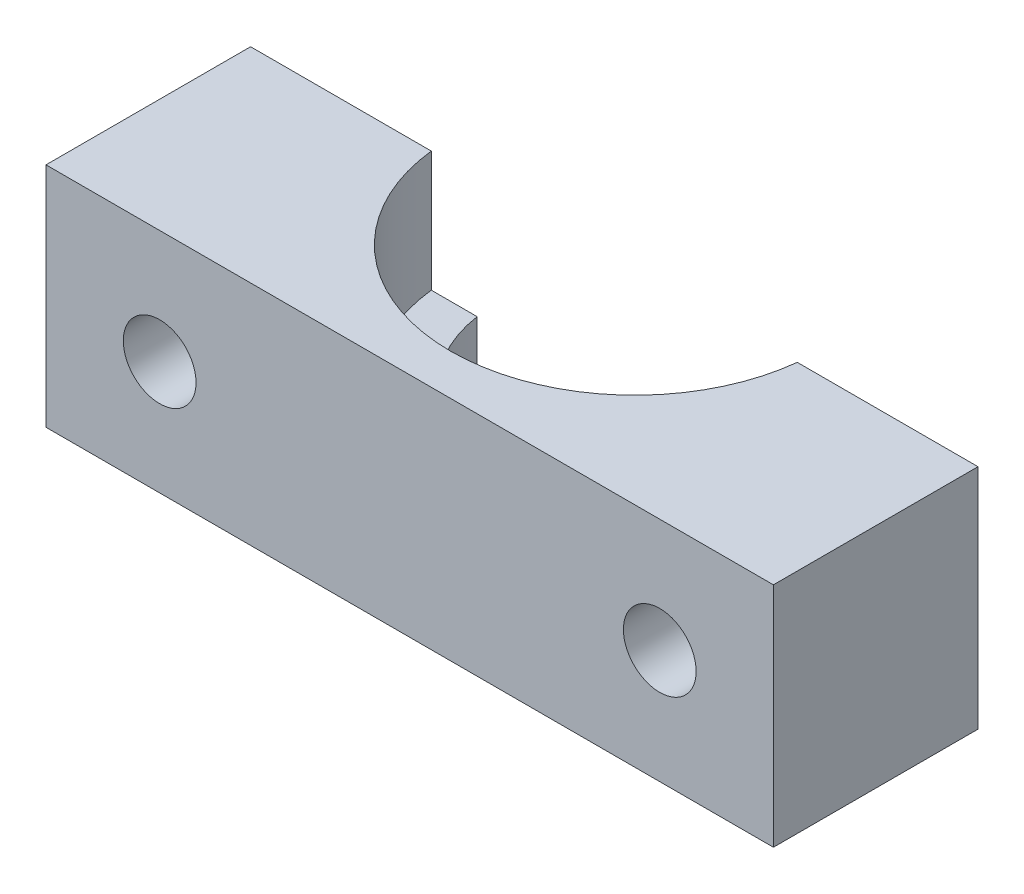
ISO-10303-21;
HEADER;
FILE_DESCRIPTION(('STEP AP214'),'2;1');
FILE_NAME('part.step','',(''),(''),'','','');
FILE_SCHEMA(('AUTOMOTIVE_DESIGN { 1 0 10303 214 1 1 1 1 }'));
ENDSEC;
DATA;
#1=APPLICATION_CONTEXT('core data for automotive mechanical design processes');
#2=APPLICATION_PROTOCOL_DEFINITION('international standard','automotive_design',2000,#1);
#3=PRODUCT_CONTEXT('',#1,'mechanical');
#4=PRODUCT('Part','Part','',(#3));
#5=PRODUCT_RELATED_PRODUCT_CATEGORY('part','',(#4));
#6=PRODUCT_DEFINITION_FORMATION('','',#4);
#7=PRODUCT_DEFINITION_CONTEXT('part definition',#1,'design');
#8=PRODUCT_DEFINITION('design','',#6,#7);
#9=PRODUCT_DEFINITION_SHAPE('','',#8);
#10=(LENGTH_UNIT() NAMED_UNIT(*) SI_UNIT(.MILLI.,.METRE.));
#11=(NAMED_UNIT(*) PLANE_ANGLE_UNIT() SI_UNIT($,.RADIAN.));
#12=(NAMED_UNIT(*) SI_UNIT($,.STERADIAN.) SOLID_ANGLE_UNIT());
#13=UNCERTAINTY_MEASURE_WITH_UNIT(LENGTH_MEASURE(1.E-05),#10,'distance_accuracy_value','');
#14=(GEOMETRIC_REPRESENTATION_CONTEXT(3) GLOBAL_UNCERTAINTY_ASSIGNED_CONTEXT((#13)) GLOBAL_UNIT_ASSIGNED_CONTEXT((#10,
#11,#12)) REPRESENTATION_CONTEXT('',''));
#15=CARTESIAN_POINT('',(0.,0.,0.));
#16=DIRECTION('',(0.,0.,1.));
#17=DIRECTION('',(1.,0.,0.));
#18=AXIS2_PLACEMENT_3D('',#15,#16,#17);
#19=CARTESIAN_POINT('',(5.,-15.,0.));
#20=DIRECTION('',(0.,0.,1.));
#21=DIRECTION('',(1.,0.,0.));
#22=AXIS2_PLACEMENT_3D('',#19,#20,#21);
#23=CYLINDRICAL_SURFACE('',#22,1.6);
#24=CARTESIAN_POINT('',(5.,-15.,25.));
#25=DIRECTION('',(0.,0.,1.));
#26=DIRECTION('',(1.,0.,0.));
#27=AXIS2_PLACEMENT_3D('',#24,#25,#26);
#28=CIRCLE('',#27,1.6);
#29=CARTESIAN_POINT('',(6.6,-15.,25.));
#30=VERTEX_POINT('',#29);
#31=EDGE_CURVE('E165',#30,#30,#28,.T.);
#32=ORIENTED_EDGE('',*,*,#31,.T.);
#33=EDGE_LOOP('',(#32));
#34=FACE_BOUND('',#33,.T.);
#35=CARTESIAN_POINT('',(5.,-15.,16.));
#36=DIRECTION('',(0.,0.,-1.));
#37=DIRECTION('',(-1.,0.,0.));
#38=AXIS2_PLACEMENT_3D('',#35,#36,#37);
#39=CIRCLE('',#38,1.6);
#40=CARTESIAN_POINT('',(3.4,-15.,16.));
#41=VERTEX_POINT('',#40);
#42=EDGE_CURVE('E173',#41,#41,#39,.F.);
#43=ORIENTED_EDGE('',*,*,#42,.F.);
#44=EDGE_LOOP('',(#43));
#45=FACE_BOUND('',#44,.T.);
#46=ADVANCED_FACE('F35',(#34,#45),#23,.F.);
#47=CARTESIAN_POINT('',(27.,-15.,0.));
#48=DIRECTION('',(0.,0.,1.));
#49=DIRECTION('',(1.,0.,0.));
#50=AXIS2_PLACEMENT_3D('',#47,#48,#49);
#51=CYLINDRICAL_SURFACE('',#50,1.6);
#52=CARTESIAN_POINT('',(27.,-15.,25.));
#53=DIRECTION('',(0.,0.,1.));
#54=DIRECTION('',(1.,0.,0.));
#55=AXIS2_PLACEMENT_3D('',#52,#53,#54);
#56=CIRCLE('',#55,1.6);
#57=CARTESIAN_POINT('',(28.6,-15.,25.));
#58=VERTEX_POINT('',#57);
#59=EDGE_CURVE('E168',#58,#58,#56,.T.);
#60=ORIENTED_EDGE('',*,*,#59,.T.);
#61=EDGE_LOOP('',(#60));
#62=FACE_BOUND('',#61,.T.);
#63=CARTESIAN_POINT('',(27.,-15.,16.));
#64=DIRECTION('',(0.,0.,-1.));
#65=DIRECTION('',(-1.,0.,0.));
#66=AXIS2_PLACEMENT_3D('',#63,#64,#65);
#67=CIRCLE('',#66,1.6);
#68=CARTESIAN_POINT('',(25.4,-15.,16.));
#69=VERTEX_POINT('',#68);
#70=EDGE_CURVE('E108',#69,#69,#67,.F.);
#71=ORIENTED_EDGE('',*,*,#70,.F.);
#72=EDGE_LOOP('',(#71));
#73=FACE_BOUND('',#72,.T.);
#74=ADVANCED_FACE('F195',(#62,#73),#51,.F.);
#75=CARTESIAN_POINT('',(15.9996874969482,-27.,15.1));
#76=DIRECTION('',(0.,1.,0.));
#77=DIRECTION('',(0.,0.,1.));
#78=AXIS2_PLACEMENT_3D('',#75,#76,#77);
#79=CYLINDRICAL_SURFACE('',#78,6.1);
#80=DIRECTION('',(0.,1.,0.));
#81=VECTOR('',#80,1.);
#82=CARTESIAN_POINT('',(9.96644624534884,-27.,16.));
#83=LINE('',#82,#81);
#84=CARTESIAN_POINT('',(9.96644624534884,-15.3,16.));
#85=VERTEX_POINT('',#84);
#86=CARTESIAN_POINT('',(9.96644624534884,-20.,16.));
#87=VERTEX_POINT('',#86);
#88=EDGE_CURVE('E103',#85,#87,#83,.F.);
#89=ORIENTED_EDGE('',*,*,#88,.F.);
#90=CARTESIAN_POINT('',(15.9996874969482,-15.3,15.1));
#91=DIRECTION('',(0.,1.,0.));
#92=DIRECTION('',(-1.,0.,0.));
#93=AXIS2_PLACEMENT_3D('',#90,#91,#92);
#94=CIRCLE('',#93,6.1);
#95=CARTESIAN_POINT('',(22.0329287485475,-15.3,16.));
#96=VERTEX_POINT('',#95);
#97=EDGE_CURVE('E129',#96,#85,#94,.F.);
#98=ORIENTED_EDGE('',*,*,#97,.F.);
#99=DIRECTION('',(0.,1.,0.));
#100=VECTOR('',#99,1.);
#101=CARTESIAN_POINT('',(22.0329287485475,-27.,16.));
#102=LINE('',#101,#100);
#103=CARTESIAN_POINT('',(22.0329287485475,-20.,16.));
#104=VERTEX_POINT('',#103);
#105=EDGE_CURVE('E162',#104,#96,#102,.T.);
#106=ORIENTED_EDGE('',*,*,#105,.F.);
#107=CARTESIAN_POINT('',(15.9996874969482,-20.,15.1));
#108=DIRECTION('',(0.,1.,0.));
#109=DIRECTION('',(0.,0.,1.));
#110=AXIS2_PLACEMENT_3D('',#107,#108,#109);
#111=CIRCLE('',#110,6.1);
#112=EDGE_CURVE('E125',#87,#104,#111,.T.);
#113=ORIENTED_EDGE('',*,*,#112,.F.);
#114=EDGE_LOOP('',(#89,#98,#106,#113));
#115=FACE_BOUND('',#114,.T.);
#116=ADVANCED_FACE('F193',(#115),#79,.F.);
#117=CARTESIAN_POINT('',(0.,0.,25.));
#118=DIRECTION('',(1.,0.,0.));
#119=DIRECTION('',(0.,1.,0.));
#120=AXIS2_PLACEMENT_3D('',#117,#118,#119);
#121=PLANE('',#120);
#122=DIRECTION('',(0.,1.,0.));
#123=VECTOR('',#122,1.);
#124=CARTESIAN_POINT('',(0.,-27.,16.));
#125=LINE('',#124,#123);
#126=CARTESIAN_POINT('',(0.,-20.,16.));
#127=VERTEX_POINT('',#126);
#128=CARTESIAN_POINT('',(0.,-10.,16.));
#129=VERTEX_POINT('',#128);
#130=EDGE_CURVE('E101',#127,#129,#125,.T.);
#131=ORIENTED_EDGE('',*,*,#130,.F.);
#132=DIRECTION('',(0.,0.,-1.));
#133=VECTOR('',#132,1.);
#134=CARTESIAN_POINT('',(0.,-20.,25.));
#135=LINE('',#134,#133);
#136=CARTESIAN_POINT('',(0.,-20.,25.));
#137=VERTEX_POINT('',#136);
#138=EDGE_CURVE('E115',#137,#127,#135,.T.);
#139=ORIENTED_EDGE('',*,*,#138,.F.);
#140=DIRECTION('',(0.,-1.,0.));
#141=VECTOR('',#140,1.);
#142=CARTESIAN_POINT('',(0.,0.,25.));
#143=LINE('',#142,#141);
#144=CARTESIAN_POINT('',(0.,-10.,25.));
#145=VERTEX_POINT('',#144);
#146=EDGE_CURVE('E140',#145,#137,#143,.T.);
#147=ORIENTED_EDGE('',*,*,#146,.F.);
#148=DIRECTION('',(0.,0.,1.));
#149=VECTOR('',#148,1.);
#150=CARTESIAN_POINT('',(0.,-10.,25.));
#151=LINE('',#150,#149);
#152=EDGE_CURVE('E117',#129,#145,#151,.T.);
#153=ORIENTED_EDGE('',*,*,#152,.F.);
#154=EDGE_LOOP('',(#131,#139,#147,#153));
#155=FACE_BOUND('',#154,.T.);
#156=ADVANCED_FACE('F37',(#155),#121,.F.);
#157=CARTESIAN_POINT('',(32.,0.,25.));
#158=DIRECTION('',(-1.,0.,0.));
#159=DIRECTION('',(0.,0.,1.));
#160=AXIS2_PLACEMENT_3D('',#157,#158,#159);
#161=PLANE('',#160);
#162=DIRECTION('',(0.,-1.,0.));
#163=VECTOR('',#162,1.);
#164=CARTESIAN_POINT('',(32.,-27.,16.));
#165=LINE('',#164,#163);
#166=CARTESIAN_POINT('',(32.,-10.,16.));
#167=VERTEX_POINT('',#166);
#168=CARTESIAN_POINT('',(32.,-20.,16.));
#169=VERTEX_POINT('',#168);
#170=EDGE_CURVE('E118',#167,#169,#165,.T.);
#171=ORIENTED_EDGE('',*,*,#170,.F.);
#172=DIRECTION('',(0.,0.,1.));
#173=VECTOR('',#172,1.);
#174=CARTESIAN_POINT('',(32.,-10.,25.));
#175=LINE('',#174,#173);
#176=CARTESIAN_POINT('',(32.,-10.,25.));
#177=VERTEX_POINT('',#176);
#178=EDGE_CURVE('E134',#167,#177,#175,.T.);
#179=ORIENTED_EDGE('',*,*,#178,.T.);
#180=DIRECTION('',(0.,1.,0.));
#181=VECTOR('',#180,1.);
#182=CARTESIAN_POINT('',(32.,0.,25.));
#183=LINE('',#182,#181);
#184=CARTESIAN_POINT('',(32.,-20.,25.));
#185=VERTEX_POINT('',#184);
#186=EDGE_CURVE('E142',#185,#177,#183,.T.);
#187=ORIENTED_EDGE('',*,*,#186,.F.);
#188=DIRECTION('',(0.,0.,-1.));
#189=VECTOR('',#188,1.);
#190=CARTESIAN_POINT('',(32.,-20.,25.));
#191=LINE('',#190,#189);
#192=EDGE_CURVE('E124',#185,#169,#191,.T.);
#193=ORIENTED_EDGE('',*,*,#192,.T.);
#194=EDGE_LOOP('',(#171,#179,#187,#193));
#195=FACE_BOUND('',#194,.T.);
#196=ADVANCED_FACE('F185',(#195),#161,.F.);
#197=CARTESIAN_POINT('',(32.,-10.,25.));
#198=DIRECTION('',(0.,-1.,0.));
#199=DIRECTION('',(1.,0.,0.));
#200=AXIS2_PLACEMENT_3D('',#197,#198,#199);
#201=PLANE('',#200);
#202=DIRECTION('',(1.,0.,0.));
#203=VECTOR('',#202,1.);
#204=CARTESIAN_POINT('',(32.,-10.,16.));
#205=LINE('',#204,#203);
#206=CARTESIAN_POINT('',(7.94984277794894,-10.,16.));
#207=VERTEX_POINT('',#206);
#208=EDGE_CURVE('E49',#129,#207,#205,.T.);
#209=ORIENTED_EDGE('',*,*,#208,.F.);
#210=ORIENTED_EDGE('',*,*,#152,.T.);
#211=DIRECTION('',(-1.,0.,0.));
#212=VECTOR('',#211,1.);
#213=CARTESIAN_POINT('',(32.,-10.,25.));
#214=LINE('',#213,#212);
#215=EDGE_CURVE('E136',#177,#145,#214,.T.);
#216=ORIENTED_EDGE('',*,*,#215,.F.);
#217=ORIENTED_EDGE('',*,*,#178,.F.);
#218=CARTESIAN_POINT('',(24.0495322159474,-10.,16.));
#219=VERTEX_POINT('',#218);
#220=EDGE_CURVE('E150',#219,#167,#205,.T.);
#221=ORIENTED_EDGE('',*,*,#220,.F.);
#222=CARTESIAN_POINT('',(15.9996874969482,-10.,15.1));
#223=DIRECTION('',(0.,1.,0.));
#224=DIRECTION('',(-1.,0.,0.));
#225=AXIS2_PLACEMENT_3D('',#222,#223,#224);
#226=CIRCLE('',#225,8.1);
#227=EDGE_CURVE('E160',#207,#219,#226,.T.);
#228=ORIENTED_EDGE('',*,*,#227,.F.);
#229=EDGE_LOOP('',(#209,#210,#216,#217,#221,#228));
#230=FACE_BOUND('',#229,.T.);
#231=ADVANCED_FACE('F159',(#230),#201,.F.);
#232=CARTESIAN_POINT('',(32.,-20.,25.));
#233=DIRECTION('',(0.,1.,0.));
#234=DIRECTION('',(0.,0.,1.));
#235=AXIS2_PLACEMENT_3D('',#232,#233,#234);
#236=PLANE('',#235);
#237=DIRECTION('',(-1.,0.,0.));
#238=VECTOR('',#237,1.);
#239=CARTESIAN_POINT('',(32.,-20.,16.));
#240=LINE('',#239,#238);
#241=EDGE_CURVE('E110',#169,#104,#240,.T.);
#242=ORIENTED_EDGE('',*,*,#241,.F.);
#243=ORIENTED_EDGE('',*,*,#192,.F.);
#244=DIRECTION('',(-1.,0.,0.));
#245=VECTOR('',#244,1.);
#246=CARTESIAN_POINT('',(32.,-20.,25.));
#247=LINE('',#246,#245);
#248=EDGE_CURVE('E123',#185,#137,#247,.T.);
#249=ORIENTED_EDGE('',*,*,#248,.T.);
#250=ORIENTED_EDGE('',*,*,#138,.T.);
#251=EDGE_CURVE('E97',#87,#127,#240,.T.);
#252=ORIENTED_EDGE('',*,*,#251,.F.);
#253=ORIENTED_EDGE('',*,*,#112,.T.);
#254=EDGE_LOOP('',(#242,#243,#249,#250,#252,#253));
#255=FACE_BOUND('',#254,.T.);
#256=ADVANCED_FACE('F121',(#255),#236,.F.);
#257=CARTESIAN_POINT('',(15.9996874969482,-15.3,15.1));
#258=DIRECTION('',(0.,1.,0.));
#259=DIRECTION('',(-1.,0.,0.));
#260=AXIS2_PLACEMENT_3D('',#257,#258,#259);
#261=PLANE('',#260);
#262=CARTESIAN_POINT('',(15.9996874969482,-15.3,15.1));
#263=DIRECTION('',(0.,1.,0.));
#264=DIRECTION('',(-1.,0.,0.));
#265=AXIS2_PLACEMENT_3D('',#262,#263,#264);
#266=CIRCLE('',#265,8.1);
#267=CARTESIAN_POINT('',(7.94984277794894,-15.3,16.));
#268=VERTEX_POINT('',#267);
#269=CARTESIAN_POINT('',(24.0495322159474,-15.3,16.));
#270=VERTEX_POINT('',#269);
#271=EDGE_CURVE('E146',#268,#270,#266,.T.);
#272=ORIENTED_EDGE('',*,*,#271,.T.);
#273=DIRECTION('',(-1.,0.,0.));
#274=VECTOR('',#273,1.);
#275=CARTESIAN_POINT('',(15.9996874969482,-15.3,16.));
#276=LINE('',#275,#274);
#277=EDGE_CURVE('E57',#270,#96,#276,.T.);
#278=ORIENTED_EDGE('',*,*,#277,.T.);
#279=ORIENTED_EDGE('',*,*,#97,.T.);
#280=EDGE_CURVE('E179',#85,#268,#276,.T.);
#281=ORIENTED_EDGE('',*,*,#280,.T.);
#282=EDGE_LOOP('',(#272,#278,#279,#281));
#283=FACE_BOUND('',#282,.T.);
#284=ADVANCED_FACE('F190',(#283),#261,.T.);
#285=CARTESIAN_POINT('',(15.9996874969482,-15.3,15.1));
#286=DIRECTION('',(0.,1.,0.));
#287=DIRECTION('',(-1.,0.,0.));
#288=AXIS2_PLACEMENT_3D('',#285,#286,#287);
#289=CYLINDRICAL_SURFACE('',#288,8.1);
#290=DIRECTION('',(0.,1.,0.));
#291=VECTOR('',#290,1.);
#292=CARTESIAN_POINT('',(7.94984277794894,-15.3,16.));
#293=LINE('',#292,#291);
#294=EDGE_CURVE('E11',#207,#268,#293,.F.);
#295=ORIENTED_EDGE('',*,*,#294,.F.);
#296=ORIENTED_EDGE('',*,*,#227,.T.);
#297=DIRECTION('',(0.,1.,0.));
#298=VECTOR('',#297,1.);
#299=CARTESIAN_POINT('',(24.0495322159474,-15.3,16.));
#300=LINE('',#299,#298);
#301=EDGE_CURVE('E43',#270,#219,#300,.T.);
#302=ORIENTED_EDGE('',*,*,#301,.F.);
#303=ORIENTED_EDGE('',*,*,#271,.F.);
#304=EDGE_LOOP('',(#295,#296,#302,#303));
#305=FACE_BOUND('',#304,.T.);
#306=ADVANCED_FACE('F164',(#305),#289,.F.);
#307=CARTESIAN_POINT('',(0.,0.,25.));
#308=DIRECTION('',(0.,0.,1.));
#309=DIRECTION('',(1.,0.,0.));
#310=AXIS2_PLACEMENT_3D('',#307,#308,#309);
#311=PLANE('',#310);
#312=ORIENTED_EDGE('',*,*,#59,.F.);
#313=EDGE_LOOP('',(#312));
#314=FACE_BOUND('',#313,.T.);
#315=ORIENTED_EDGE('',*,*,#31,.F.);
#316=EDGE_LOOP('',(#315));
#317=FACE_BOUND('',#316,.T.);
#318=ORIENTED_EDGE('',*,*,#248,.F.);
#319=ORIENTED_EDGE('',*,*,#186,.T.);
#320=ORIENTED_EDGE('',*,*,#215,.T.);
#321=ORIENTED_EDGE('',*,*,#146,.T.);
#322=EDGE_LOOP('',(#318,#319,#320,#321));
#323=FACE_BOUND('',#322,.T.);
#324=ADVANCED_FACE('F187',(#314,#317,#323),#311,.T.);
#325=CARTESIAN_POINT('',(0.,0.,16.));
#326=DIRECTION('',(0.,0.,-1.));
#327=DIRECTION('',(-1.,0.,0.));
#328=AXIS2_PLACEMENT_3D('',#325,#326,#327);
#329=PLANE('',#328);
#330=ORIENTED_EDGE('',*,*,#241,.T.);
#331=ORIENTED_EDGE('',*,*,#105,.T.);
#332=ORIENTED_EDGE('',*,*,#277,.F.);
#333=ORIENTED_EDGE('',*,*,#301,.T.);
#334=ORIENTED_EDGE('',*,*,#220,.T.);
#335=ORIENTED_EDGE('',*,*,#170,.T.);
#336=EDGE_LOOP('',(#330,#331,#332,#333,#334,#335));
#337=FACE_BOUND('',#336,.T.);
#338=ORIENTED_EDGE('',*,*,#70,.T.);
#339=EDGE_LOOP('',(#338));
#340=FACE_BOUND('',#339,.T.);
#341=ADVANCED_FACE('F148',(#337,#340),#329,.T.);
#342=ORIENTED_EDGE('',*,*,#251,.T.);
#343=ORIENTED_EDGE('',*,*,#130,.T.);
#344=ORIENTED_EDGE('',*,*,#208,.T.);
#345=ORIENTED_EDGE('',*,*,#294,.T.);
#346=ORIENTED_EDGE('',*,*,#280,.F.);
#347=ORIENTED_EDGE('',*,*,#88,.T.);
#348=EDGE_LOOP('',(#342,#343,#344,#345,#346,#347));
#349=FACE_BOUND('',#348,.T.);
#350=ORIENTED_EDGE('',*,*,#42,.T.);
#351=EDGE_LOOP('',(#350));
#352=FACE_BOUND('',#351,.T.);
#353=ADVANCED_FACE('F99',(#349,#352),#329,.T.);
#354=CLOSED_SHELL('',(#46,#74,#116,#156,#196,#231,#256,#284,#306,#324,#341,#353));
#355=MANIFOLD_SOLID_BREP('B2',#354);
#356=ADVANCED_BREP_SHAPE_REPRESENTATION('',(#18,#355),#14);
#357=SHAPE_DEFINITION_REPRESENTATION(#9,#356);
ENDSEC;
END-ISO-10303-21;
